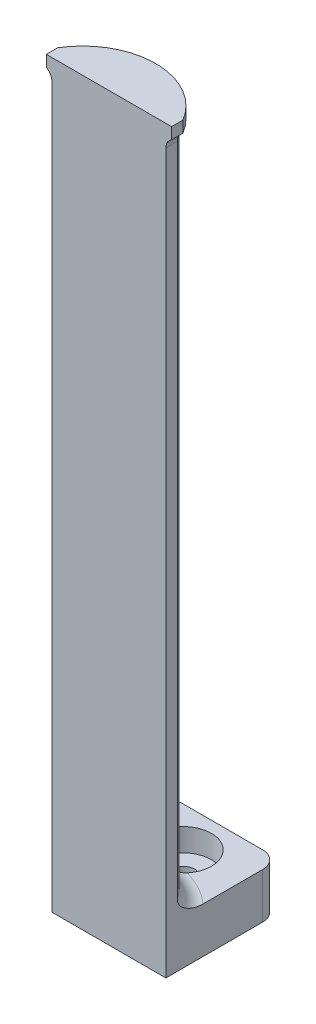
ISO-10303-21;
HEADER;
FILE_DESCRIPTION(('STEP AP214'),'2;1');
FILE_NAME('part.step','',(''),(''),'','','');
FILE_SCHEMA(('AUTOMOTIVE_DESIGN { 1 0 10303 214 1 1 1 1 }'));
ENDSEC;
DATA;
#1=APPLICATION_CONTEXT('core data for automotive mechanical design processes');
#2=APPLICATION_PROTOCOL_DEFINITION('international standard','automotive_design',2000,#1);
#3=PRODUCT_CONTEXT('',#1,'mechanical');
#4=PRODUCT('Part','Part','',(#3));
#5=PRODUCT_RELATED_PRODUCT_CATEGORY('part','',(#4));
#6=PRODUCT_DEFINITION_FORMATION('','',#4);
#7=PRODUCT_DEFINITION_CONTEXT('part definition',#1,'design');
#8=PRODUCT_DEFINITION('design','',#6,#7);
#9=PRODUCT_DEFINITION_SHAPE('','',#8);
#10=(LENGTH_UNIT() NAMED_UNIT(*) SI_UNIT(.MILLI.,.METRE.));
#11=(NAMED_UNIT(*) PLANE_ANGLE_UNIT() SI_UNIT($,.RADIAN.));
#12=(NAMED_UNIT(*) SI_UNIT($,.STERADIAN.) SOLID_ANGLE_UNIT());
#13=UNCERTAINTY_MEASURE_WITH_UNIT(LENGTH_MEASURE(1.E-05),#10,'distance_accuracy_value','');
#14=(GEOMETRIC_REPRESENTATION_CONTEXT(3) GLOBAL_UNCERTAINTY_ASSIGNED_CONTEXT((#13)) GLOBAL_UNIT_ASSIGNED_CONTEXT((#10,
#11,#12)) REPRESENTATION_CONTEXT('',''));
#15=CARTESIAN_POINT('',(0.,0.,0.));
#16=DIRECTION('',(0.,0.,1.));
#17=DIRECTION('',(1.,0.,0.));
#18=AXIS2_PLACEMENT_3D('',#15,#16,#17);
#19=CARTESIAN_POINT('',(0.,-8.,-11.));
#20=DIRECTION('',(0.,1.,0.));
#21=DIRECTION('',(0.,0.,1.));
#22=AXIS2_PLACEMENT_3D('',#19,#20,#21);
#23=CYLINDRICAL_SURFACE('',#22,2.1);
#24=CARTESIAN_POINT('',(0.,-8.,-11.));
#25=DIRECTION('',(0.,1.,0.));
#26=DIRECTION('',(0.,0.,1.));
#27=AXIS2_PLACEMENT_3D('',#24,#25,#26);
#28=CIRCLE('',#27,2.1);
#29=CARTESIAN_POINT('',(0.,-8.,-8.9));
#30=VERTEX_POINT('',#29);
#31=EDGE_CURVE('E188',#30,#30,#28,.T.);
#32=ORIENTED_EDGE('',*,*,#31,.F.);
#33=EDGE_LOOP('',(#32));
#34=FACE_BOUND('',#33,.T.);
#35=CARTESIAN_POINT('',(0.,-4.,-11.));
#36=DIRECTION('',(0.,1.,0.));
#37=DIRECTION('',(0.,0.,1.));
#38=AXIS2_PLACEMENT_3D('',#35,#36,#37);
#39=CIRCLE('',#38,2.1);
#40=CARTESIAN_POINT('',(0.,-4.,-8.9));
#41=VERTEX_POINT('',#40);
#42=EDGE_CURVE('E185',#41,#41,#39,.F.);
#43=ORIENTED_EDGE('',*,*,#42,.F.);
#44=EDGE_LOOP('',(#43));
#45=FACE_BOUND('',#44,.T.);
#46=ADVANCED_FACE('F35',(#34,#45),#23,.F.);
#47=CARTESIAN_POINT('',(0.,120.,6.6332495807108));
#48=DIRECTION('',(0.,-1.,0.));
#49=DIRECTION('',(0.,0.,-1.));
#50=AXIS2_PLACEMENT_3D('',#47,#48,#49);
#51=CYLINDRICAL_SURFACE('',#50,12.);
#52=CARTESIAN_POINT('',(-10.,118.267949192431,0.));
#53=CARTESIAN_POINT('',(-10.0000006344976,118.284499881133,7.70455485506158E-07));
#54=CARTESIAN_POINT('',(-10.0002056981213,118.301033970581,0.000309946625266893));
#55=CARTESIAN_POINT('',(-10.001024683621,118.334068950967,0.00154511039346454));
#56=CARTESIAN_POINT('',(-10.0016386054971,118.350569841906,0.00247109799192386));
#57=CARTESIAN_POINT('',(-10.0024569564994,118.367054133591,0.00370549130472211));
#58=B_SPLINE_CURVE_WITH_KNOTS('',3,(#52,#53,#54,#55,#56,#57),.UNSPECIFIED.,.F.,.F.,(4,2,4),(0.,
0.0496147537899057,0.0992295075832748),.UNSPECIFIED.);
#59=CARTESIAN_POINT('',(-10.,118.267949192431,0.));
#60=VERTEX_POINT('',#59);
#61=CARTESIAN_POINT('',(-10.0024569564994,118.367054133591,0.00370549130472211));
#62=VERTEX_POINT('',#61);
#63=EDGE_CURVE('E331',#60,#62,#58,.T.);
#64=ORIENTED_EDGE('',*,*,#63,.T.);
#65=CARTESIAN_POINT('',(0.,118.367054133591,6.6332495807108));
#66=DIRECTION('',(0.,1.,0.));
#67=DIRECTION('',(0.,0.,1.));
#68=AXIS2_PLACEMENT_3D('',#65,#66,#67);
#69=CIRCLE('',#68,12.);
#70=CARTESIAN_POINT('',(10.0024569564994,118.367054133591,0.00370549130472211));
#71=VERTEX_POINT('',#70);
#72=EDGE_CURVE('E56',#62,#71,#69,.F.);
#73=ORIENTED_EDGE('',*,*,#72,.T.);
#74=CARTESIAN_POINT('',(10.0024569564994,118.367054133591,0.00370549130472211));
#75=CARTESIAN_POINT('',(10.0016386054971,118.350569841906,0.00247109799194646));
#76=CARTESIAN_POINT('',(10.001024683621,118.334068950967,0.0015451103934871));
#77=CARTESIAN_POINT('',(10.0002056981213,118.301033970581,0.00030994662524405));
#78=CARTESIAN_POINT('',(10.0000006344975,118.284499881133,7.70455417335265E-07));
#79=CARTESIAN_POINT('',(10.,118.267949192431,-1.36110679067516E-13));
#80=B_SPLINE_CURVE_WITH_KNOTS('',3,(#74,#75,#76,#77,#78,#79),.UNSPECIFIED.,.F.,.F.,(4,2,4),(0.,
0.0496147537933691,0.0992295075832774),.UNSPECIFIED.);
#81=CARTESIAN_POINT('',(10.,118.267949192431,0.));
#82=VERTEX_POINT('',#81);
#83=EDGE_CURVE('E48',#71,#82,#80,.T.);
#84=ORIENTED_EDGE('',*,*,#83,.T.);
#85=DIRECTION('',(0.,-1.,0.));
#86=VECTOR('',#85,1.);
#87=CARTESIAN_POINT('',(10.,120.,0.));
#88=LINE('',#87,#86);
#89=CARTESIAN_POINT('',(10.,3.,0.));
#90=VERTEX_POINT('',#89);
#91=EDGE_CURVE('E201',#82,#90,#88,.T.);
#92=ORIENTED_EDGE('',*,*,#91,.T.);
#93=CARTESIAN_POINT('',(0.,3.,6.6332495807108));
#94=DIRECTION('',(0.,1.,0.));
#95=DIRECTION('',(0.,0.,1.));
#96=AXIS2_PLACEMENT_3D('',#93,#94,#95);
#97=CIRCLE('',#96,12.);
#98=CARTESIAN_POINT('',(-10.,3.,0.));
#99=VERTEX_POINT('',#98);
#100=EDGE_CURVE('E212',#90,#99,#97,.T.);
#101=ORIENTED_EDGE('',*,*,#100,.T.);
#102=DIRECTION('',(0.,-1.,0.));
#103=VECTOR('',#102,1.);
#104=CARTESIAN_POINT('',(-10.,120.,0.));
#105=LINE('',#104,#103);
#106=EDGE_CURVE('E210',#60,#99,#105,.T.);
#107=ORIENTED_EDGE('',*,*,#106,.F.);
#108=EDGE_LOOP('',(#64,#73,#84,#92,#101,#107));
#109=FACE_BOUND('',#108,.T.);
#110=ADVANCED_FACE('F243',(#109),#51,.T.);
#111=CARTESIAN_POINT('',(0.,0.,0.));
#112=DIRECTION('',(0.,1.,0.));
#113=DIRECTION('',(0.,0.,1.));
#114=AXIS2_PLACEMENT_3D('',#111,#112,#113);
#115=PLANE('',#114);
#116=CARTESIAN_POINT('',(0.,0.,-11.));
#117=DIRECTION('',(0.,1.,0.));
#118=DIRECTION('',(0.,0.,1.));
#119=AXIS2_PLACEMENT_3D('',#116,#117,#118);
#120=CIRCLE('',#119,5.);
#121=CARTESIAN_POINT('',(3.88660542498167,0.,-7.85447965027993));
#122=VERTEX_POINT('',#121);
#123=CARTESIAN_POINT('',(-3.88660542498167,0.,-7.85447965027993));
#124=VERTEX_POINT('',#123);
#125=EDGE_CURVE('E186',#122,#124,#120,.T.);
#126=ORIENTED_EDGE('',*,*,#125,.F.);
#127=CARTESIAN_POINT('',(0.,0.,6.6332495807108));
#128=DIRECTION('',(0.,1.,0.));
#129=DIRECTION('',(0.,0.,1.));
#130=AXIS2_PLACEMENT_3D('',#127,#128,#129);
#131=CIRCLE('',#130,15.);
#132=CARTESIAN_POINT('',(10.,0.,-4.54709030678815));
#133=VERTEX_POINT('',#132);
#134=EDGE_CURVE('E215',#122,#133,#131,.F.);
#135=ORIENTED_EDGE('',*,*,#134,.T.);
#136=DIRECTION('',(0.,0.,1.));
#137=VECTOR('',#136,1.);
#138=CARTESIAN_POINT('',(10.,0.,0.));
#139=LINE('',#138,#137);
#140=CARTESIAN_POINT('',(10.,0.,-15.));
#141=VERTEX_POINT('',#140);
#142=EDGE_CURVE('E191',#141,#133,#139,.T.);
#143=ORIENTED_EDGE('',*,*,#142,.F.);
#144=CARTESIAN_POINT('',(7.,0.,-15.));
#145=DIRECTION('',(0.,1.,0.));
#146=DIRECTION('',(0.,0.,1.));
#147=AXIS2_PLACEMENT_3D('',#144,#145,#146);
#148=CIRCLE('',#147,3.);
#149=CARTESIAN_POINT('',(7.,0.,-18.));
#150=VERTEX_POINT('',#149);
#151=EDGE_CURVE('E300',#141,#150,#148,.T.);
#152=ORIENTED_EDGE('',*,*,#151,.T.);
#153=DIRECTION('',(1.,0.,0.));
#154=VECTOR('',#153,1.);
#155=CARTESIAN_POINT('',(10.,0.,-18.));
#156=LINE('',#155,#154);
#157=CARTESIAN_POINT('',(-7.,0.,-18.));
#158=VERTEX_POINT('',#157);
#159=EDGE_CURVE('E195',#158,#150,#156,.T.);
#160=ORIENTED_EDGE('',*,*,#159,.F.);
#161=CARTESIAN_POINT('',(-7.,0.,-15.));
#162=DIRECTION('',(0.,1.,0.));
#163=DIRECTION('',(0.,0.,1.));
#164=AXIS2_PLACEMENT_3D('',#161,#162,#163);
#165=CIRCLE('',#164,3.);
#166=CARTESIAN_POINT('',(-10.,0.,-15.));
#167=VERTEX_POINT('',#166);
#168=EDGE_CURVE('E299',#158,#167,#165,.T.);
#169=ORIENTED_EDGE('',*,*,#168,.T.);
#170=DIRECTION('',(0.,0.,-1.));
#171=VECTOR('',#170,1.);
#172=CARTESIAN_POINT('',(-10.,0.,0.));
#173=LINE('',#172,#171);
#174=CARTESIAN_POINT('',(-10.,0.,-4.54709030678815));
#175=VERTEX_POINT('',#174);
#176=EDGE_CURVE('E204',#175,#167,#173,.T.);
#177=ORIENTED_EDGE('',*,*,#176,.F.);
#178=EDGE_CURVE('E216',#175,#124,#131,.F.);
#179=ORIENTED_EDGE('',*,*,#178,.T.);
#180=EDGE_LOOP('',(#126,#135,#143,#152,#160,#169,#177,#179));
#181=FACE_BOUND('',#180,.T.);
#182=ADVANCED_FACE('F276',(#181),#115,.T.);
#183=CARTESIAN_POINT('',(10.,-8.,0.));
#184=DIRECTION('',(-1.,0.,0.));
#185=DIRECTION('',(0.,0.,1.));
#186=AXIS2_PLACEMENT_3D('',#183,#184,#185);
#187=PLANE('',#186);
#188=ORIENTED_EDGE('',*,*,#91,.F.);
#189=DIRECTION('',(0.,0.,-1.));
#190=VECTOR('',#189,1.);
#191=CARTESIAN_POINT('',(10.,118.267949192431,0.));
#192=LINE('',#191,#190);
#193=CARTESIAN_POINT('',(10.,118.267949192431,2.));
#194=VERTEX_POINT('',#193);
#195=EDGE_CURVE('E325',#82,#194,#192,.F.);
#196=ORIENTED_EDGE('',*,*,#195,.T.);
#197=DIRECTION('',(0.,1.,0.));
#198=VECTOR('',#197,1.);
#199=CARTESIAN_POINT('',(10.,120.,2.));
#200=LINE('',#199,#198);
#201=CARTESIAN_POINT('',(10.,-8.,2.));
#202=VERTEX_POINT('',#201);
#203=EDGE_CURVE('E181',#202,#194,#200,.T.);
#204=ORIENTED_EDGE('',*,*,#203,.F.);
#205=DIRECTION('',(0.,0.,1.));
#206=VECTOR('',#205,1.);
#207=CARTESIAN_POINT('',(10.,-8.,0.));
#208=LINE('',#207,#206);
#209=CARTESIAN_POINT('',(10.,-8.,-15.));
#210=VERTEX_POINT('',#209);
#211=EDGE_CURVE('E192',#210,#202,#208,.T.);
#212=ORIENTED_EDGE('',*,*,#211,.F.);
#213=DIRECTION('',(0.,1.,0.));
#214=VECTOR('',#213,1.);
#215=CARTESIAN_POINT('',(10.,-8.,-15.));
#216=LINE('',#215,#214);
#217=EDGE_CURVE('E258',#210,#141,#216,.T.);
#218=ORIENTED_EDGE('',*,*,#217,.T.);
#219=ORIENTED_EDGE('',*,*,#142,.T.);
#220=CARTESIAN_POINT('',(10.,0.,-4.54709030678815));
#221=CARTESIAN_POINT('',(10.,2.45667950123257E-05,-4.38574645608543));
#222=CARTESIAN_POINT('',(10.,0.00723066505348418,-4.22446150557407));
#223=CARTESIAN_POINT('',(10.,0.0353273153937686,-3.90313191533755));
#224=CARTESIAN_POINT('',(10.,0.0562134736052458,-3.74308689405688));
#225=CARTESIAN_POINT('',(10.,0.11136805441,-3.4230758106674));
#226=CARTESIAN_POINT('',(10.,0.145816034494874,-3.26314091816503));
#227=CARTESIAN_POINT('',(10.,0.227597291311341,-2.94659161798994));
#228=CARTESIAN_POINT('',(10.,0.274931365114446,-2.78997741636526));
#229=CARTESIAN_POINT('',(10.,0.382615096422341,-2.4799755936431));
#230=CARTESIAN_POINT('',(10.,0.443058979715371,-2.32662065195902));
#231=CARTESIAN_POINT('',(10.,0.576793548683761,-2.02552026208566));
#232=CARTESIAN_POINT('',(10.,0.650089362540703,-1.87777708184164));
#233=CARTESIAN_POINT('',(10.,0.809403592218839,-1.59043916781549));
#234=CARTESIAN_POINT('',(10.,0.895342707347177,-1.45080070921055));
#235=CARTESIAN_POINT('',(10.,1.08097390011191,-1.18111527128585));
#236=CARTESIAN_POINT('',(10.,1.18064841271973,-1.05105636235455));
#237=CARTESIAN_POINT('',(10.,1.37587179114769,-0.826094460132072));
#238=CARTESIAN_POINT('',(10.,1.46895527572621,-0.729069471930688));
#239=CARTESIAN_POINT('',(10.,1.66626235566257,-0.5467315970043));
#240=CARTESIAN_POINT('',(10.,1.7704963312149,-0.461429795340072));
#241=CARTESIAN_POINT('',(10.,1.99246039389884,-0.306075410708397));
#242=CARTESIAN_POINT('',(10.,2.11036422939866,-0.236261825256658));
#243=CARTESIAN_POINT('',(10.,2.29529120596511,-0.149484575382667));
#244=CARTESIAN_POINT('',(10.,2.35815990553379,-0.12357954770205));
#245=CARTESIAN_POINT('',(10.,2.48626552871879,-0.0785701258350071));
#246=CARTESIAN_POINT('',(10.,2.55150038696563,-0.0594599508382668));
#247=CARTESIAN_POINT('',(10.,2.68012980981298,-0.0297030379592797));
#248=CARTESIAN_POINT('',(10.,2.74342977418696,-0.0186504383394069));
#249=CARTESIAN_POINT('',(10.,2.87113647811314,-0.00375564596328939));
#250=CARTESIAN_POINT('',(10.,2.93554675637443,5.59808173509131E-05));
#251=CARTESIAN_POINT('',(10.,3.,0.));
#252=B_SPLINE_CURVE_WITH_KNOTS('',3,(#220,#221,#222,#223,#224,#225,#226,#227,#228,#229,#230,
#231,#232,#233,#234,#235,#236,#237,#238,#239,#240,#241,#242,#243,#244,#245,#246,#247,#248,#249,
#250,#251),.UNSPECIFIED.,.F.,.F.,(4,2,2,2,2,2,2,2,2,2,2,2,2,2,2,4),(0.,0.4837876846312,
0.967420058638288,1.45768350424396,1.94797728207117,2.44191924213824,2.93605874547637,
3.42722155470139,3.91776198794497,4.32033727971272,4.72329065224446,5.13208569231605,
5.33576067863839,5.53926196882329,5.73162882951419,5.92480593042345),.UNSPECIFIED.);
#253=EDGE_CURVE('E226',#133,#90,#252,.T.);
#254=ORIENTED_EDGE('',*,*,#253,.T.);
#255=EDGE_LOOP('',(#188,#196,#204,#212,#218,#219,#254));
#256=FACE_BOUND('',#255,.T.);
#257=ADVANCED_FACE('F278',(#256),#187,.F.);
#258=CARTESIAN_POINT('',(-10.,-8.,0.));
#259=DIRECTION('',(1.,0.,0.));
#260=DIRECTION('',(0.,0.,-1.));
#261=AXIS2_PLACEMENT_3D('',#258,#259,#260);
#262=PLANE('',#261);
#263=DIRECTION('',(0.,-1.,0.));
#264=VECTOR('',#263,1.);
#265=CARTESIAN_POINT('',(-10.,120.,2.));
#266=LINE('',#265,#264);
#267=CARTESIAN_POINT('',(-10.,118.267949192431,2.));
#268=VERTEX_POINT('',#267);
#269=CARTESIAN_POINT('',(-10.,-8.,2.));
#270=VERTEX_POINT('',#269);
#271=EDGE_CURVE('E171',#268,#270,#266,.T.);
#272=ORIENTED_EDGE('',*,*,#271,.F.);
#273=DIRECTION('',(0.,0.,1.));
#274=VECTOR('',#273,1.);
#275=CARTESIAN_POINT('',(-10.,118.267949192431,0.));
#276=LINE('',#275,#274);
#277=EDGE_CURVE('E257',#268,#60,#276,.F.);
#278=ORIENTED_EDGE('',*,*,#277,.T.);
#279=ORIENTED_EDGE('',*,*,#106,.T.);
#280=CARTESIAN_POINT('',(-10.,3.,0.));
#281=CARTESIAN_POINT('',(-10.,2.94941463124245,2.24726680272377E-05));
#282=CARTESIAN_POINT('',(-10.,2.89884211420061,-0.00231389923123839));
#283=CARTESIAN_POINT('',(-10.,2.79817024927895,-0.0115295126729778));
#284=CARTESIAN_POINT('',(-10.,2.74807041794723,-0.0184034477416614));
#285=CARTESIAN_POINT('',(-10.,2.64923114624779,-0.0364181048290336));
#286=CARTESIAN_POINT('',(-10.,2.60048273964327,-0.0475099061161641));
#287=CARTESIAN_POINT('',(-10.,2.50406317872259,-0.0736691714064105));
#288=CARTESIAN_POINT('',(-10.,2.45639240197935,-0.0887380061166216));
#289=CARTESIAN_POINT('',(-10.,2.29054185705117,-0.148346957913529));
#290=CARTESIAN_POINT('',(-10.,2.17582352940995,-0.202759160707597));
#291=CARTESIAN_POINT('',(-10.,1.95627236801133,-0.329320108967349));
#292=CARTESIAN_POINT('',(-10.,1.85149289188355,-0.401557829932846));
#293=CARTESIAN_POINT('',(-10.,1.67396070715668,-0.541698426887507));
#294=CARTESIAN_POINT('',(-10.,1.5992051046985,-0.607114463895027));
#295=CARTESIAN_POINT('',(-10.,1.45562283282566,-0.744201613888277));
#296=CARTESIAN_POINT('',(-10.,1.3867995559265,-0.815876259437148));
#297=CARTESIAN_POINT('',(-10.,1.25469468551493,-0.964302627227587));
#298=CARTESIAN_POINT('',(-10.,1.19142067933182,-1.04106105637518));
#299=CARTESIAN_POINT('',(-10.,1.07018521344318,-1.19867670532179));
#300=CARTESIAN_POINT('',(-10.,1.01222541764832,-1.27953519665076));
#301=CARTESIAN_POINT('',(-10.,0.870748351126438,-1.49025411767752));
#302=CARTESIAN_POINT('',(-10.,0.790793159266038,-1.62251604646732));
#303=CARTESIAN_POINT('',(-10.,0.642420777964612,-1.89338998977134));
#304=CARTESIAN_POINT('',(-10.,0.574009738978362,-2.03200533954618));
#305=CARTESIAN_POINT('',(-10.,0.448456288981312,-2.31425593639396));
#306=CARTESIAN_POINT('',(-10.,0.391315171770542,-2.45789175759718));
#307=CARTESIAN_POINT('',(-10.,0.288303612258125,-2.74910673884631));
#308=CARTESIAN_POINT('',(-10.,0.242430257247353,-2.89668486884813));
#309=CARTESIAN_POINT('',(-10.,0.169320670847826,-3.16825651730062));
#310=CARTESIAN_POINT('',(-10.,0.140218857241185,-3.29175145277988));
#311=CARTESIAN_POINT('',(-10.,0.0899547779877396,-3.54033074850993));
#312=CARTESIAN_POINT('',(-10.,0.068791127322006,-3.66541482755219));
#313=CARTESIAN_POINT('',(-10.,0.0347283207048764,-3.91628188189548));
#314=CARTESIAN_POINT('',(-10.,0.0218016212322315,-4.04206109414974));
#315=CARTESIAN_POINT('',(-10.,0.00444023967471008,-4.29424867470732));
#316=CARTESIAN_POINT('',(-10.,8.77547342230396E-06,-4.42065726324003));
#317=CARTESIAN_POINT('',(-10.,0.,-4.54709030678815));
#318=B_SPLINE_CURVE_WITH_KNOTS('',3,(#280,#281,#282,#283,#284,#285,#286,#287,#288,#289,#290,
#291,#292,#293,#294,#295,#296,#297,#298,#299,#300,#301,#302,#303,#304,#305,#306,#307,#308,#309,
#310,#311,#312,#313,#314,#315,#316,#317),.UNSPECIFIED.,.F.,.F.,(4,2,2,2,2,2,2,2,2,2,2,2,2,2,2,2,
2,2,4),(0.,0.151681351259592,0.303185631587005,0.452983796200811,0.602833657175188,
0.981451028039703,1.361997901791,1.6596022356706,1.95737564659853,2.25555004435044,
2.55381748570933,3.01680011437101,3.48002863585347,3.94331030559056,4.40647209098796,
4.78685989613552,5.16718130183339,5.5462241838547,5.92541061399591),.UNSPECIFIED.);
#319=EDGE_CURVE('E219',#99,#175,#318,.T.);
#320=ORIENTED_EDGE('',*,*,#319,.T.);
#321=ORIENTED_EDGE('',*,*,#176,.T.);
#322=DIRECTION('',(0.,1.,0.));
#323=VECTOR('',#322,1.);
#324=CARTESIAN_POINT('',(-10.,-8.,-15.));
#325=LINE('',#324,#323);
#326=CARTESIAN_POINT('',(-10.,-8.,-15.));
#327=VERTEX_POINT('',#326);
#328=EDGE_CURVE('E305',#167,#327,#325,.F.);
#329=ORIENTED_EDGE('',*,*,#328,.T.);
#330=DIRECTION('',(0.,0.,-1.));
#331=VECTOR('',#330,1.);
#332=CARTESIAN_POINT('',(-10.,-8.,0.));
#333=LINE('',#332,#331);
#334=EDGE_CURVE('E194',#270,#327,#333,.T.);
#335=ORIENTED_EDGE('',*,*,#334,.F.);
#336=EDGE_LOOP('',(#272,#278,#279,#320,#321,#329,#335));
#337=FACE_BOUND('',#336,.T.);
#338=ADVANCED_FACE('F232',(#337),#262,.F.);
#339=CARTESIAN_POINT('',(10.,-8.,-18.));
#340=DIRECTION('',(0.,0.,1.));
#341=DIRECTION('',(1.,0.,0.));
#342=AXIS2_PLACEMENT_3D('',#339,#340,#341);
#343=PLANE('',#342);
#344=DIRECTION('',(1.,0.,0.));
#345=VECTOR('',#344,1.);
#346=CARTESIAN_POINT('',(10.,-8.,-18.));
#347=LINE('',#346,#345);
#348=CARTESIAN_POINT('',(-7.,-8.,-18.));
#349=VERTEX_POINT('',#348);
#350=CARTESIAN_POINT('',(7.,-8.,-18.));
#351=VERTEX_POINT('',#350);
#352=EDGE_CURVE('E198',#349,#351,#347,.T.);
#353=ORIENTED_EDGE('',*,*,#352,.F.);
#354=DIRECTION('',(0.,1.,0.));
#355=VECTOR('',#354,1.);
#356=CARTESIAN_POINT('',(-7.,-8.,-18.));
#357=LINE('',#356,#355);
#358=EDGE_CURVE('E289',#349,#158,#357,.T.);
#359=ORIENTED_EDGE('',*,*,#358,.T.);
#360=ORIENTED_EDGE('',*,*,#159,.T.);
#361=DIRECTION('',(0.,1.,0.));
#362=VECTOR('',#361,1.);
#363=CARTESIAN_POINT('',(7.,-8.,-18.));
#364=LINE('',#363,#362);
#365=EDGE_CURVE('E292',#150,#351,#364,.F.);
#366=ORIENTED_EDGE('',*,*,#365,.T.);
#367=EDGE_LOOP('',(#353,#359,#360,#366));
#368=FACE_BOUND('',#367,.T.);
#369=ADVANCED_FACE('F274',(#368),#343,.F.);
#370=CARTESIAN_POINT('',(0.,-8.,0.));
#371=DIRECTION('',(0.,1.,0.));
#372=DIRECTION('',(0.,0.,1.));
#373=AXIS2_PLACEMENT_3D('',#370,#371,#372);
#374=PLANE('',#373);
#375=ORIENTED_EDGE('',*,*,#31,.T.);
#376=EDGE_LOOP('',(#375));
#377=FACE_BOUND('',#376,.T.);
#378=ORIENTED_EDGE('',*,*,#334,.T.);
#379=CARTESIAN_POINT('',(-7.,-8.,-15.));
#380=DIRECTION('',(0.,1.,0.));
#381=DIRECTION('',(0.,0.,1.));
#382=AXIS2_PLACEMENT_3D('',#379,#380,#381);
#383=CIRCLE('',#382,3.);
#384=EDGE_CURVE('E298',#327,#349,#383,.F.);
#385=ORIENTED_EDGE('',*,*,#384,.T.);
#386=ORIENTED_EDGE('',*,*,#352,.T.);
#387=CARTESIAN_POINT('',(7.,-8.,-15.));
#388=DIRECTION('',(0.,1.,0.));
#389=DIRECTION('',(0.,0.,1.));
#390=AXIS2_PLACEMENT_3D('',#387,#388,#389);
#391=CIRCLE('',#390,3.);
#392=EDGE_CURVE('E307',#351,#210,#391,.F.);
#393=ORIENTED_EDGE('',*,*,#392,.T.);
#394=ORIENTED_EDGE('',*,*,#211,.T.);
#395=DIRECTION('',(1.,0.,0.));
#396=VECTOR('',#395,1.);
#397=CARTESIAN_POINT('',(-10.,-8.,2.));
#398=LINE('',#397,#396);
#399=EDGE_CURVE('E173',#270,#202,#398,.T.);
#400=ORIENTED_EDGE('',*,*,#399,.F.);
#401=EDGE_LOOP('',(#378,#385,#386,#393,#394,#400));
#402=FACE_BOUND('',#401,.T.);
#403=ADVANCED_FACE('F241',(#377,#402),#374,.F.);
#404=CARTESIAN_POINT('',(0.,3.,6.6332495807108));
#405=DIRECTION('',(0.,1.,0.));
#406=DIRECTION('',(0.,0.,1.));
#407=AXIS2_PLACEMENT_3D('',#404,#405,#406);
#408=TOROIDAL_SURFACE('',#407,15.,3.);
#409=ORIENTED_EDGE('',*,*,#134,.F.);
#410=CARTESIAN_POINT('',(4.25053524929728,0.0587493886185295,-8.3669504192892));
#411=CARTESIAN_POINT('',(4.20586597633188,0.0423367423067718,-8.29479738652631));
#412=CARTESIAN_POINT('',(4.15897524632466,0.0295049878824883,-8.22324568019948));
#413=CARTESIAN_POINT('',(4.06119922597061,0.0106631463614589,-8.08213125770239));
#414=CARTESIAN_POINT('',(4.01031923577035,0.00464416665828721,-8.01256606451989));
#415=CARTESIAN_POINT('',(3.90552076517099,-0.000920023380407513,-7.87683022533181));
#416=CARTESIAN_POINT('',(3.85164558340162,-0.00054132308873065,-7.81062906176429));
#417=CARTESIAN_POINT('',(3.74071915894545,0.00601865156107786,-7.68122238279594));
#418=CARTESIAN_POINT('',(3.68366675391714,0.0122020627822565,-7.61801797958109));
#419=CARTESIAN_POINT('',(3.5540219214285,0.0317571651427291,-7.48153239988418));
#420=CARTESIAN_POINT('',(3.48075904777409,0.0464048764929101,-7.40906928160826));
#421=CARTESIAN_POINT('',(3.33079516026823,0.0824340382234949,-7.26954223686603));
#422=CARTESIAN_POINT('',(3.25409172954771,0.10382028778998,-7.20248220135069));
#423=CARTESIAN_POINT('',(3.0189900659366,0.176659840601749,-7.00914051211118));
#424=CARTESIAN_POINT('',(2.85619936726156,0.236687303720629,-6.89132189821779));
#425=CARTESIAN_POINT('',(2.56504183453896,0.353415642793017,-6.7055442451204));
#426=CARTESIAN_POINT('',(2.43851986550884,0.407040484128521,-6.63254010811566));
#427=CARTESIAN_POINT('',(2.1809218367443,0.518441032729683,-6.49836983992643));
#428=CARTESIAN_POINT('',(2.04984164162802,0.576220562838082,-6.43721480758713));
#429=CARTESIAN_POINT('',(1.78297484840061,0.691951987502827,-6.32647003144189));
#430=CARTESIAN_POINT('',(1.64718845099817,0.749903874612417,-6.27687979511945));
#431=CARTESIAN_POINT('',(1.37024699720412,0.861127351294946,-6.18922890670635));
#432=CARTESIAN_POINT('',(1.22909844757921,0.914404369092946,-6.15115475350298));
#433=CARTESIAN_POINT('',(0.935542487813468,1.01146521277528,-6.08593856963706));
#434=CARTESIAN_POINT('',(0.782919595863801,1.05489222868043,-6.05918377158746));
#435=CARTESIAN_POINT('',(0.549756077152734,1.1044302565937,-6.02970164100852));
#436=CARTESIAN_POINT('',(0.47153927771313,1.11832642789615,-6.02165650485638));
#437=CARTESIAN_POINT('',(0.313992775491901,1.14000505134168,-6.00924426791305));
#438=CARTESIAN_POINT('',(0.234663750346024,1.14779107434128,-6.00487501877406));
#439=CARTESIAN_POINT('',(0.0746762050942058,1.15665022514019,-5.99991065412758));
#440=CARTESIAN_POINT('',(-0.00598756463549474,1.15765276341452,-5.99935522467731));
#441=CARTESIAN_POINT('',(-0.167027919317705,1.15266655513929,-6.00214160522661));
#442=CARTESIAN_POINT('',(-0.247404491937736,1.14667751189993,-6.00548358061369));
#443=CARTESIAN_POINT('',(-0.407463644118907,1.128198429251,-6.01598206537871));
#444=CARTESIAN_POINT('',(-0.487142139263852,1.11568237358721,-6.02315384286965));
#445=CARTESIAN_POINT('',(-0.645022305452736,1.08510111840321,-6.04114267541374));
#446=CARTESIAN_POINT('',(-0.723223161946565,1.06703294785039,-6.05196168246402));
#447=CARTESIAN_POINT('',(-0.918962030185514,1.01573934670489,-6.08371055905352));
#448=CARTESIAN_POINT('',(-1.03534451507713,0.979559374089902,-6.10695894875822));
#449=CARTESIAN_POINT('',(-1.26412796666053,0.900830699142685,-6.16101010495472));
#450=CARTESIAN_POINT('',(-1.3765257223057,0.85827699868156,-6.19181881228404));
#451=CARTESIAN_POINT('',(-1.59821737864153,0.769842002761306,-6.26088294861876));
#452=CARTESIAN_POINT('',(-1.70749672058214,0.723947821293483,-6.29916829033938));
#453=CARTESIAN_POINT('',(-1.92288455708384,0.63156558606983,-6.38308886159493));
#454=CARTESIAN_POINT('',(-2.0289939307261,0.585077702158766,-6.42872203060679));
#455=CARTESIAN_POINT('',(-2.25213299261128,0.487601064637202,-6.53401156067541));
#456=CARTESIAN_POINT('',(-2.36876194123368,0.436825186856541,-6.59472309567906));
#457=CARTESIAN_POINT('',(-2.59838049191007,0.339961051312773,-6.72613546939727));
#458=CARTESIAN_POINT('',(-2.71136886342532,0.293874367402042,-6.79683964308256));
#459=CARTESIAN_POINT('',(-2.93268608099066,0.20926988910278,-6.94818341030035));
#460=CARTESIAN_POINT('',(-3.0410344342613,0.170717333813977,-7.02877444060292));
#461=CARTESIAN_POINT('',(-3.25256410749759,0.103621161876438,-7.20008552869145));
#462=CARTESIAN_POINT('',(-3.35575045516194,0.0750676370021584,-7.29079544125769));
#463=CARTESIAN_POINT('',(-3.57421540040697,0.0265496161632775,-7.49975345389088));
#464=CARTESIAN_POINT('',(-3.6882204356452,0.00913594105617117,-7.61999636082697));
#465=CARTESIAN_POINT('',(-3.8500199871561,-0.000451486572313811,-7.80872318331353));
#466=CARTESIAN_POINT('',(-3.90238629106351,-0.000897040086250551,-7.87297972985255));
#467=CARTESIAN_POINT('',(-4.00374713719066,0.00412249106250111,-8.00386305839386));
#468=CARTESIAN_POINT('',(-4.05274364689848,0.0095840950719999,-8.07048842226649));
#469=CARTESIAN_POINT('',(-4.12617989195975,0.0229605739254944,-8.17568465346045));
#470=CARTESIAN_POINT('',(-4.15190639542635,0.0287259774231706,-8.21364735064065));
#471=CARTESIAN_POINT('',(-4.20214172278461,0.0422404578260847,-8.29000112867364));
#472=CARTESIAN_POINT('',(-4.22665100662685,0.0499887785311135,-8.32839204089731));
#473=CARTESIAN_POINT('',(-4.25053524929729,0.0587493886185177,-8.3669504192892));
#474=B_SPLINE_CURVE_WITH_KNOTS('',3,(#410,#411,#412,#413,#414,#415,#416,#417,#418,#419,#420,
#421,#422,#423,#424,#425,#426,#427,#428,#429,#430,#431,#432,#433,#434,#435,#436,#437,#438,#439,
#440,#441,#442,#443,#444,#445,#446,#447,#448,#449,#450,#451,#452,#453,#454,#455,#456,#457,#458,
#459,#460,#461,#462,#463,#464,#465,#466,#467,#468,#469,#470,#471,#472,#473),.UNSPECIFIED.,.F.,
.F.,(4,2,2,2,2,2,2,2,2,2,2,2,2,2,2,2,2,2,2,2,2,2,2,2,2,2,2,2,2,2,2,4),(0.,0.259148724976961,
0.517958795748294,0.773692956898911,1.02952129728915,1.34128183960074,1.65326492152533,
2.27981375448594,2.74611061228705,3.21284215263351,3.67955381238878,4.14571617334129,
4.62674050478356,4.86600910699234,5.10513777291745,5.34675105616405,5.58837459271366,
5.83096867085675,6.0736927920162,6.44526989992786,6.81713993043951,7.19052941021665,
7.56381436358667,7.98622781887073,8.40878258596276,8.82933919353826,9.24947787658726,
9.74700414623937,9.99543249057856,10.2437145340834,10.3823198670504,10.5208724204073),.UNSPECIFIED.);
#475=EDGE_CURVE('E249',#122,#124,#474,.T.);
#476=ORIENTED_EDGE('',*,*,#475,.T.);
#477=ORIENTED_EDGE('',*,*,#178,.F.);
#478=ORIENTED_EDGE('',*,*,#319,.F.);
#479=ORIENTED_EDGE('',*,*,#100,.F.);
#480=ORIENTED_EDGE('',*,*,#253,.F.);
#481=EDGE_LOOP('',(#409,#476,#477,#478,#479,#480));
#482=FACE_BOUND('',#481,.T.);
#483=ADVANCED_FACE('F235',(#482),#408,.F.);
#484=CARTESIAN_POINT('',(-7.,-8.,-15.));
#485=DIRECTION('',(0.,1.,0.));
#486=DIRECTION('',(0.,0.,1.));
#487=AXIS2_PLACEMENT_3D('',#484,#485,#486);
#488=CYLINDRICAL_SURFACE('',#487,3.);
#489=ORIENTED_EDGE('',*,*,#384,.F.);
#490=ORIENTED_EDGE('',*,*,#328,.F.);
#491=ORIENTED_EDGE('',*,*,#168,.F.);
#492=ORIENTED_EDGE('',*,*,#358,.F.);
#493=EDGE_LOOP('',(#489,#490,#491,#492));
#494=FACE_BOUND('',#493,.T.);
#495=ADVANCED_FACE('F240',(#494),#488,.T.);
#496=CARTESIAN_POINT('',(7.,-8.,-15.));
#497=DIRECTION('',(0.,1.,0.));
#498=DIRECTION('',(0.,0.,1.));
#499=AXIS2_PLACEMENT_3D('',#496,#497,#498);
#500=CYLINDRICAL_SURFACE('',#499,3.);
#501=ORIENTED_EDGE('',*,*,#392,.F.);
#502=ORIENTED_EDGE('',*,*,#365,.F.);
#503=ORIENTED_EDGE('',*,*,#151,.F.);
#504=ORIENTED_EDGE('',*,*,#217,.F.);
#505=EDGE_LOOP('',(#501,#502,#503,#504));
#506=FACE_BOUND('',#505,.T.);
#507=ADVANCED_FACE('F348',(#506),#500,.T.);
#508=CARTESIAN_POINT('',(0.,-4.,-11.));
#509=DIRECTION('',(0.,1.,0.));
#510=DIRECTION('',(0.,0.,1.));
#511=AXIS2_PLACEMENT_3D('',#508,#509,#510);
#512=PLANE('',#511);
#513=CARTESIAN_POINT('',(0.,-4.,-11.));
#514=DIRECTION('',(0.,1.,0.));
#515=DIRECTION('',(0.,0.,1.));
#516=AXIS2_PLACEMENT_3D('',#513,#514,#515);
#517=CIRCLE('',#516,5.);
#518=CARTESIAN_POINT('',(0.,-4.,-6.));
#519=VERTEX_POINT('',#518);
#520=EDGE_CURVE('E182',#519,#519,#517,.T.);
#521=ORIENTED_EDGE('',*,*,#520,.T.);
#522=EDGE_LOOP('',(#521));
#523=FACE_BOUND('',#522,.T.);
#524=ORIENTED_EDGE('',*,*,#42,.T.);
#525=EDGE_LOOP('',(#524));
#526=FACE_BOUND('',#525,.T.);
#527=ADVANCED_FACE('F266',(#523,#526),#512,.T.);
#528=CARTESIAN_POINT('',(0.,-4.,-11.));
#529=DIRECTION('',(0.,1.,0.));
#530=DIRECTION('',(0.,0.,1.));
#531=AXIS2_PLACEMENT_3D('',#528,#529,#530);
#532=CYLINDRICAL_SURFACE('',#531,5.);
#533=ORIENTED_EDGE('',*,*,#125,.T.);
#534=ORIENTED_EDGE('',*,*,#475,.F.);
#535=EDGE_LOOP('',(#533,#534));
#536=FACE_BOUND('',#535,.T.);
#537=ORIENTED_EDGE('',*,*,#520,.F.);
#538=EDGE_LOOP('',(#537));
#539=FACE_BOUND('',#538,.T.);
#540=ADVANCED_FACE('F261',(#536,#539),#532,.F.);
#541=CARTESIAN_POINT('',(0.,0.,2.));
#542=DIRECTION('',(0.,0.,1.));
#543=DIRECTION('',(1.,0.,0.));
#544=AXIS2_PLACEMENT_3D('',#541,#542,#543);
#545=PLANE('',#544);
#546=DIRECTION('',(0.,-1.,0.));
#547=VECTOR('',#546,1.);
#548=CARTESIAN_POINT('',(-11.,122.,2.));
#549=LINE('',#548,#547);
#550=CARTESIAN_POINT('',(-11.,122.,2.));
#551=VERTEX_POINT('',#550);
#552=CARTESIAN_POINT('',(-11.,120.,2.));
#553=VERTEX_POINT('',#552);
#554=EDGE_CURVE('E149',#551,#553,#549,.T.);
#555=ORIENTED_EDGE('',*,*,#554,.T.);
#556=CARTESIAN_POINT('',(-12.,118.267949192431,2.));
#557=DIRECTION('',(0.,0.,1.));
#558=DIRECTION('',(1.,0.,0.));
#559=AXIS2_PLACEMENT_3D('',#556,#557,#558);
#560=CIRCLE('',#559,2.);
#561=EDGE_CURVE('E333',#553,#268,#560,.F.);
#562=ORIENTED_EDGE('',*,*,#561,.T.);
#563=ORIENTED_EDGE('',*,*,#271,.T.);
#564=ORIENTED_EDGE('',*,*,#399,.T.);
#565=ORIENTED_EDGE('',*,*,#203,.T.);
#566=CARTESIAN_POINT('',(12.,118.267949192431,2.));
#567=DIRECTION('',(0.,0.,1.));
#568=DIRECTION('',(1.,0.,0.));
#569=AXIS2_PLACEMENT_3D('',#566,#567,#568);
#570=CIRCLE('',#569,2.);
#571=CARTESIAN_POINT('',(11.,120.,2.));
#572=VERTEX_POINT('',#571);
#573=EDGE_CURVE('E11',#194,#572,#570,.F.);
#574=ORIENTED_EDGE('',*,*,#573,.T.);
#575=DIRECTION('',(0.,-1.,0.));
#576=VECTOR('',#575,1.);
#577=CARTESIAN_POINT('',(11.,122.,2.));
#578=LINE('',#577,#576);
#579=CARTESIAN_POINT('',(11.,122.,2.));
#580=VERTEX_POINT('',#579);
#581=EDGE_CURVE('E152',#580,#572,#578,.T.);
#582=ORIENTED_EDGE('',*,*,#581,.F.);
#583=DIRECTION('',(1.,0.,0.));
#584=VECTOR('',#583,1.);
#585=CARTESIAN_POINT('',(-11.,122.,2.));
#586=LINE('',#585,#584);
#587=EDGE_CURVE('E145',#551,#580,#586,.T.);
#588=ORIENTED_EDGE('',*,*,#587,.F.);
#589=EDGE_LOOP('',(#555,#562,#563,#564,#565,#574,#582,#588));
#590=FACE_BOUND('',#589,.T.);
#591=ADVANCED_FACE('F147',(#590),#545,.T.);
#592=CARTESIAN_POINT('',(-11.,122.,0.));
#593=DIRECTION('',(1.,0.,0.));
#594=DIRECTION('',(0.,0.,-1.));
#595=AXIS2_PLACEMENT_3D('',#592,#593,#594);
#596=PLANE('',#595);
#597=DIRECTION('',(0.,0.,1.));
#598=VECTOR('',#597,1.);
#599=CARTESIAN_POINT('',(-11.,120.,0.));
#600=LINE('',#599,#598);
#601=CARTESIAN_POINT('',(-11.,120.,0.));
#602=VERTEX_POINT('',#601);
#603=EDGE_CURVE('E169',#602,#553,#600,.T.);
#604=ORIENTED_EDGE('',*,*,#603,.T.);
#605=ORIENTED_EDGE('',*,*,#554,.F.);
#606=DIRECTION('',(0.,0.,1.));
#607=VECTOR('',#606,1.);
#608=CARTESIAN_POINT('',(-11.,122.,0.));
#609=LINE('',#608,#607);
#610=CARTESIAN_POINT('',(-11.,122.,0.));
#611=VERTEX_POINT('',#610);
#612=EDGE_CURVE('E156',#611,#551,#609,.T.);
#613=ORIENTED_EDGE('',*,*,#612,.F.);
#614=DIRECTION('',(0.,-1.,0.));
#615=VECTOR('',#614,1.);
#616=CARTESIAN_POINT('',(-11.,122.,0.));
#617=LINE('',#616,#615);
#618=EDGE_CURVE('E380',#611,#602,#617,.T.);
#619=ORIENTED_EDGE('',*,*,#618,.T.);
#620=EDGE_LOOP('',(#604,#605,#613,#619));
#621=FACE_BOUND('',#620,.T.);
#622=ADVANCED_FACE('F167',(#621),#596,.F.);
#623=CARTESIAN_POINT('',(11.,122.,2.));
#624=DIRECTION('',(-1.,0.,0.));
#625=DIRECTION('',(0.,0.,1.));
#626=AXIS2_PLACEMENT_3D('',#623,#624,#625);
#627=PLANE('',#626);
#628=DIRECTION('',(0.,0.,-1.));
#629=VECTOR('',#628,1.);
#630=CARTESIAN_POINT('',(11.,120.,2.));
#631=LINE('',#630,#629);
#632=CARTESIAN_POINT('',(11.,120.,0.));
#633=VERTEX_POINT('',#632);
#634=EDGE_CURVE('E372',#572,#633,#631,.T.);
#635=ORIENTED_EDGE('',*,*,#634,.T.);
#636=DIRECTION('',(0.,-1.,0.));
#637=VECTOR('',#636,1.);
#638=CARTESIAN_POINT('',(11.,122.,0.));
#639=LINE('',#638,#637);
#640=CARTESIAN_POINT('',(11.,122.,0.));
#641=VERTEX_POINT('',#640);
#642=EDGE_CURVE('E175',#641,#633,#639,.T.);
#643=ORIENTED_EDGE('',*,*,#642,.F.);
#644=DIRECTION('',(0.,0.,-1.));
#645=VECTOR('',#644,1.);
#646=CARTESIAN_POINT('',(11.,122.,2.));
#647=LINE('',#646,#645);
#648=EDGE_CURVE('E155',#580,#641,#647,.T.);
#649=ORIENTED_EDGE('',*,*,#648,.F.);
#650=ORIENTED_EDGE('',*,*,#581,.T.);
#651=EDGE_LOOP('',(#635,#643,#649,#650));
#652=FACE_BOUND('',#651,.T.);
#653=ADVANCED_FACE('F370',(#652),#627,.F.);
#654=CARTESIAN_POINT('',(0.,122.,6.6332495807108));
#655=DIRECTION('',(0.,-1.,0.));
#656=DIRECTION('',(0.,0.,-1.));
#657=AXIS2_PLACEMENT_3D('',#654,#655,#656);
#658=CYLINDRICAL_SURFACE('',#657,12.8452325786651);
#659=CARTESIAN_POINT('',(0.,120.,6.6332495807108));
#660=DIRECTION('',(0.,1.,0.));
#661=DIRECTION('',(0.,0.,-1.));
#662=AXIS2_PLACEMENT_3D('',#659,#660,#661);
#663=CIRCLE('',#662,12.8452325786651);
#664=EDGE_CURVE('E165',#633,#602,#663,.T.);
#665=ORIENTED_EDGE('',*,*,#664,.T.);
#666=ORIENTED_EDGE('',*,*,#618,.F.);
#667=CARTESIAN_POINT('',(0.,122.,6.6332495807108));
#668=DIRECTION('',(0.,1.,0.));
#669=DIRECTION('',(0.,0.,-1.));
#670=AXIS2_PLACEMENT_3D('',#667,#668,#669);
#671=CIRCLE('',#670,12.8452325786651);
#672=EDGE_CURVE('E161',#641,#611,#671,.T.);
#673=ORIENTED_EDGE('',*,*,#672,.F.);
#674=ORIENTED_EDGE('',*,*,#642,.T.);
#675=EDGE_LOOP('',(#665,#666,#673,#674));
#676=FACE_BOUND('',#675,.T.);
#677=ADVANCED_FACE('F382',(#676),#658,.T.);
#678=CARTESIAN_POINT('',(0.,122.,6.6332495807108));
#679=DIRECTION('',(0.,-1.,0.));
#680=DIRECTION('',(0.,0.,-1.));
#681=AXIS2_PLACEMENT_3D('',#678,#679,#680);
#682=PLANE('',#681);
#683=ORIENTED_EDGE('',*,*,#612,.T.);
#684=ORIENTED_EDGE('',*,*,#587,.T.);
#685=ORIENTED_EDGE('',*,*,#648,.T.);
#686=ORIENTED_EDGE('',*,*,#672,.T.);
#687=EDGE_LOOP('',(#683,#684,#685,#686));
#688=FACE_BOUND('',#687,.T.);
#689=ADVANCED_FACE('F159',(#688),#682,.F.);
#690=CARTESIAN_POINT('',(12.,118.267949192431,6.6332495807108));
#691=DIRECTION('',(0.,0.,-1.));
#692=DIRECTION('',(-1.,0.,0.));
#693=AXIS2_PLACEMENT_3D('',#690,#691,#692);
#694=CYLINDRICAL_SURFACE('',#693,2.);
#695=ORIENTED_EDGE('',*,*,#195,.F.);
#696=ORIENTED_EDGE('',*,*,#83,.F.);
#697=CARTESIAN_POINT('',(10.0024569564994,118.367054133591,0.00370549130472211));
#698=CARTESIAN_POINT('',(10.00517510304,118.421981196282,0.00782035447012565));
#699=CARTESIAN_POINT('',(10.0101748560225,118.476841768049,0.0112601620358859));
#700=CARTESIAN_POINT('',(10.0246882112675,118.58601876658,0.0168851701879446));
#701=CARTESIAN_POINT('',(10.03420107527,118.640335280859,0.019070575841611));
#702=CARTESIAN_POINT('',(10.0576562983206,118.747866591877,0.0222786556121951));
#703=CARTESIAN_POINT('',(10.0715850255804,118.801084249295,0.0233048642684688));
#704=CARTESIAN_POINT('',(10.1037738187695,118.906189408736,0.024332200560816));
#705=CARTESIAN_POINT('',(10.1220339368997,118.958076894721,0.0243333158420834));
#706=CARTESIAN_POINT('',(10.1831496172883,119.111225918714,0.0230112046157959));
#707=CARTESIAN_POINT('',(10.2323510161919,119.210021996821,0.0203636918755792));
#708=CARTESIAN_POINT('',(10.3462964843875,119.398157035359,0.0130933360498804));
#709=CARTESIAN_POINT('',(10.4110468739721,119.487492128794,0.00846968911564135));
#710=CARTESIAN_POINT('',(10.5192478931091,119.613513098538,0.00187598271618612));
#711=CARTESIAN_POINT('',(10.5576605437561,119.654606995292,-0.000287385716932698));
#712=CARTESIAN_POINT('',(10.6378267124448,119.733432387292,-0.00397309180210829));
#713=CARTESIAN_POINT('',(10.6795796308315,119.771164483499,-0.00549554420741778));
#714=CARTESIAN_POINT('',(10.7662196431722,119.843054653029,-0.00727134537880094));
#715=CARTESIAN_POINT('',(10.8111122256036,119.877206192935,-0.00752241241094921));
#716=CARTESIAN_POINT('',(10.9036184601424,119.9416092154,-0.00573506857829561));
#717=CARTESIAN_POINT('',(10.9512344017479,119.97185734473,-0.00369470366250891));
#718=CARTESIAN_POINT('',(11.,120.,0.));
#719=B_SPLINE_CURVE_WITH_KNOTS('',3,(#697,#698,#699,#700,#701,#702,#703,#704,#705,#706,#707,
#708,#709,#710,#711,#712,#713,#714,#715,#716,#717,#718),.UNSPECIFIED.,.F.,.F.,(4,2,2,2,2,2,2,2,
2,2,4),(0.,0.165386576261516,0.330746107716998,0.49560006427092,0.660456007705922,
0.990022392031852,1.3197229646372,1.48843255428326,1.65711192434385,1.8260939134103,
1.99522011375013),.UNSPECIFIED.);
#720=EDGE_CURVE('E40',#633,#71,#719,.F.);
#721=ORIENTED_EDGE('',*,*,#720,.F.);
#722=ORIENTED_EDGE('',*,*,#634,.F.);
#723=ORIENTED_EDGE('',*,*,#573,.F.);
#724=EDGE_LOOP('',(#695,#696,#721,#722,#723));
#725=FACE_BOUND('',#724,.T.);
#726=ADVANCED_FACE('F37',(#725),#694,.F.);
#727=CARTESIAN_POINT('',(0.,118.367054133591,6.6332495807108));
#728=DIRECTION('',(0.,1.,0.));
#729=DIRECTION('',(0.,0.,1.));
#730=AXIS2_PLACEMENT_3D('',#727,#728,#729);
#731=TOROIDAL_SURFACE('',#730,14.,2.);
#732=ORIENTED_EDGE('',*,*,#72,.F.);
#733=CARTESIAN_POINT('',(-12.6490427828147,120.159705906725,3.17522310555429));
#734=CARTESIAN_POINT('',(-12.6261647061287,120.167531247484,3.03165689045918));
#735=CARTESIAN_POINT('',(-12.6017247868897,120.175475021445,2.88833028753136));
#736=CARTESIAN_POINT('',(-12.5491633285944,120.191279220808,2.60219102300527));
#737=CARTESIAN_POINT('',(-12.5210378406306,120.199139546894,2.45937908392686));
#738=CARTESIAN_POINT('',(-12.4605017611713,120.214461765364,2.17417821396783));
#739=CARTESIAN_POINT('',(-12.4280782922185,120.221922361858,2.03179192368808));
#740=CARTESIAN_POINT('',(-12.3579723047255,120.235981178968,1.74832154690007));
#741=CARTESIAN_POINT('',(-12.3202923223849,120.242579812514,1.6072368671737));
#742=CARTESIAN_POINT('',(-12.2468251184375,120.252923228375,1.35868350318217));
#743=CARTESIAN_POINT('',(-12.212520471084,120.256976064496,1.25079540957439));
#744=CARTESIAN_POINT('',(-12.1374041648921,120.263587031228,1.0369504022507));
#745=CARTESIAN_POINT('',(-12.0965796585923,120.266142163177,0.930997771565368));
#746=CARTESIAN_POINT('',(-12.0146483618398,120.268221341336,0.74640977945548));
#747=CARTESIAN_POINT('',(-11.9755986769913,120.268290546446,0.666912997713203));
#748=CARTESIAN_POINT('',(-11.9097016723066,120.266027006616,0.552004699039848));
#749=CARTESIAN_POINT('',(-11.8865541221256,120.26488127625,0.514475624734433));
#750=CARTESIAN_POINT('',(-11.8372438147135,120.261469766608,0.441529580030273));
#751=CARTESIAN_POINT('',(-11.8110839046941,120.259205038426,0.406110662444727));
#752=CARTESIAN_POINT('',(-11.750187184146,120.252563401058,0.332240094486678));
#753=CARTESIAN_POINT('',(-11.7147527286024,120.247881940691,0.294373317177034));
#754=CARTESIAN_POINT('',(-11.6386830025956,120.235414918381,0.224984337698801));
#755=CARTESIAN_POINT('',(-11.5980626026807,120.227638102285,0.193444633000621));
#756=CARTESIAN_POINT('',(-11.5124460270487,120.208107076144,0.138096290804742));
#757=CARTESIAN_POINT('',(-11.4674319957792,120.196336110204,0.114321064570742));
#758=CARTESIAN_POINT('',(-11.3752712209143,120.168486954913,0.0745757885276652));
#759=CARTESIAN_POINT('',(-11.3281188918575,120.15239687252,0.0586276394392711));
#760=CARTESIAN_POINT('',(-11.2140485677141,120.108439291321,0.0277123010923942));
#761=CARTESIAN_POINT('',(-11.1471099673049,120.078460394689,0.0159437159498037));
#762=CARTESIAN_POINT('',(-11.0162305890024,120.010842323509,0.000120093193954175));
#763=CARTESIAN_POINT('',(-10.9522993122721,119.973180646573,-0.00391191493525533));
#764=CARTESIAN_POINT('',(-10.8455578003441,119.902023568856,-0.00718661091851383));
#765=CARTESIAN_POINT('',(-10.8016907764795,119.870131027345,-0.00742559724337041));
#766=CARTESIAN_POINT('',(-10.716692361668,119.802896260517,-0.00648634330535168));
#767=CARTESIAN_POINT('',(-10.6755619897764,119.767552762112,-0.00530757819261698));
#768=CARTESIAN_POINT('',(-10.5567411610929,119.656729332536,-0.000665401271227704));
#769=CARTESIAN_POINT('',(-10.483527645683,119.576394098997,0.00390403632714767));
#770=CARTESIAN_POINT('',(-10.3502176366858,119.403851533293,0.0126767895967718));
#771=CARTESIAN_POINT('',(-10.29030439128,119.311503210121,0.0168745620242012));
#772=CARTESIAN_POINT('',(-10.1864135299197,119.11819648942,0.0227597972019987));
#773=CARTESIAN_POINT('',(-10.1424254116483,119.017243820769,0.0244489166499779));
#774=CARTESIAN_POINT('',(-10.0769646883049,118.825276590562,0.0239626853719453));
#775=CARTESIAN_POINT('',(-10.0530917235707,118.735070994912,0.0223336263533401));
#776=CARTESIAN_POINT('',(-10.018136816861,118.552329098825,0.0156763747286195));
#777=CARTESIAN_POINT('',(-10.0070552814328,118.459792724404,0.010648074093165));
#778=CARTESIAN_POINT('',(-9.99705226608502,118.25805283854,-0.00445454766366346));
#779=CARTESIAN_POINT('',(-10.0006039544702,118.148772187047,-0.0152591153119157));
#780=CARTESIAN_POINT('',(-10.0252677723546,117.932918671439,-0.0425967408096069));
#781=CARTESIAN_POINT('',(-10.0463874395461,117.826346989861,-0.0591322557944602));
#782=CARTESIAN_POINT('',(-10.1051088210758,117.619129920274,-0.0981895807265224));
#783=CARTESIAN_POINT('',(-10.1426931414954,117.518478404902,-0.120705063339973));
#784=CARTESIAN_POINT('',(-10.2326325830563,117.325753227209,-0.172024890009925));
#785=CARTESIAN_POINT('',(-10.2849909880329,117.233681477971,-0.200830631879903));
#786=CARTESIAN_POINT('',(-10.4031427066262,117.059106712237,-0.265844497507816));
#787=CARTESIAN_POINT('',(-10.4691373070287,116.97678008069,-0.302163537411547));
#788=CARTESIAN_POINT('',(-10.5751497112613,116.863493168293,-0.363080246607413));
#789=CARTESIAN_POINT('',(-10.6116722005846,116.827419817907,-0.384468023308928));
#790=CARTESIAN_POINT('',(-10.686483961192,116.758895566115,-0.429788430977365));
#791=CARTESIAN_POINT('',(-10.7247725701799,116.726443322153,-0.453720112300138));
#792=CARTESIAN_POINT('',(-10.8150005716401,116.655483566904,-0.512934584607852));
#793=CARTESIAN_POINT('',(-10.8673363321836,116.618430375293,-0.549380234374639));
#794=CARTESIAN_POINT('',(-10.9711631024767,116.551771140543,-0.629587773078358));
#795=CARTESIAN_POINT('',(-11.0226554639308,116.522151804555,-0.673336366518567));
#796=CARTESIAN_POINT('',(-11.1065333379214,116.478171474465,-0.757024562303464));
#797=CARTESIAN_POINT('',(-11.1402273752487,116.461860904857,-0.794591465871035));
#798=CARTESIAN_POINT('',(-11.2022475583219,116.433623951214,-0.875277031248348));
#799=CARTESIAN_POINT('',(-11.230591329816,116.421683045375,-0.918376648871682));
#800=CARTESIAN_POINT('',(-11.2799205984085,116.401881108974,-1.00974112581242));
#801=CARTESIAN_POINT('',(-11.3008704951846,116.39403973219,-1.05802955321195));
#802=CARTESIAN_POINT('',(-11.3346752341301,116.381770280961,-1.15782033107328));
#803=CARTESIAN_POINT('',(-11.3475108730762,116.377350298093,-1.20932999096374));
#804=CARTESIAN_POINT('',(-11.3640639826933,116.371732834066,-1.30179897268681));
#805=CARTESIAN_POINT('',(-11.3691896724694,116.370031675267,-1.34249974975788));
#806=CARTESIAN_POINT('',(-11.3760453945215,116.367766530229,-1.42423254055592));
#807=CARTESIAN_POINT('',(-11.3777729323491,116.367203379347,-1.46526477542491));
#808=CARTESIAN_POINT('',(-11.3785320354952,116.366955581793,-1.54776810130825));
#809=CARTESIAN_POINT('',(-11.3775352312407,116.367280179596,-1.58923929631889));
#810=CARTESIAN_POINT('',(-11.3733739599639,116.36864818544,-1.67203610183986));
#811=CARTESIAN_POINT('',(-11.3702102536407,116.369691341229,-1.71336175832637));
#812=CARTESIAN_POINT('',(-11.3586409341706,116.373556981818,-1.83219941693914));
#813=CARTESIAN_POINT('',(-11.3480731448735,116.377137327631,-1.90947278534878));
#814=CARTESIAN_POINT('',(-11.3229309512241,116.385994183097,-2.06328276821318));
#815=CARTESIAN_POINT('',(-11.3083535098597,116.391271978956,-2.13981877851096));
#816=CARTESIAN_POINT('',(-11.2763049349439,116.403395553993,-2.2923977450452));
#817=CARTESIAN_POINT('',(-11.2588250533706,116.410246098112,-2.36843846565086));
#818=CARTESIAN_POINT('',(-11.2217327918241,116.425477216673,-2.51984686115257));
#819=CARTESIAN_POINT('',(-11.202120075496,116.433858032587,-2.59521442785612));
#820=CARTESIAN_POINT('',(-11.1441762089376,116.459841544109,-2.8080514931537));
#821=CARTESIAN_POINT('',(-11.1039013640127,116.47929720652,-2.94477471059183));
#822=CARTESIAN_POINT('',(-11.0408641476242,116.512779027543,-3.14775255764854));
#823=CARTESIAN_POINT('',(-11.0194968329495,116.524605204981,-3.21482005048432));
#824=CARTESIAN_POINT('',(-10.9759807511687,116.549806519606,-3.3484003366512));
#825=CARTESIAN_POINT('',(-10.9538320631663,116.563181500309,-3.41491318529464));
#826=CARTESIAN_POINT('',(-10.9313559386207,116.577387194136,-3.48114392323867));
#827=B_SPLINE_CURVE_WITH_KNOTS('',3,(#733,#734,#735,#736,#737,#738,#739,#740,#741,#742,#743,
#744,#745,#746,#747,#748,#749,#750,#751,#752,#753,#754,#755,#756,#757,#758,#759,#760,#761,#762,
#763,#764,#765,#766,#767,#768,#769,#770,#771,#772,#773,#774,#775,#776,#777,#778,#779,#780,#781,
#782,#783,#784,#785,#786,#787,#788,#789,#790,#791,#792,#793,#794,#795,#796,#797,#798,#799,#800,
#801,#802,#803,#804,#805,#806,#807,#808,#809,#810,#811,#812,#813,#814,#815,#816,#817,#818,#819,
#820,#821,#822,#823,#824,#825,#826),.UNSPECIFIED.,.F.,.F.,(4,2,2,2,2,2,2,2,2,2,2,2,2,2,2,2,2,2,
2,2,2,2,2,2,2,2,2,2,2,2,2,2,2,2,2,2,2,2,2,2,2,2,2,2,2,2,4),(0.,0.436779236894075,
0.874030347612362,1.31262246567531,1.75100369593089,2.09072306811623,2.43112031413869,
2.69627470515223,2.82847214536767,2.96054564569633,3.11616248911782,3.27134272748266,
3.4271821819831,3.58345523507082,3.80507267680096,4.02734879037967,4.18985540765037,
4.35242220319475,4.67722313178669,5.00625412234263,5.33506772626917,5.61410592769087,
5.89315299748178,6.2211339568689,6.54925571193494,6.87703165886126,7.204880518002,
7.53796748788615,7.70463537968118,7.87124127110921,8.09193324488079,8.3122277306324,
8.47074055240821,8.62872169521474,8.787453435114,8.94655943732895,9.06955792149632,
9.19264666032104,9.31702203729393,9.44135377419093,9.67536902796026,9.90956202123633,
10.1444741354831,10.3794233499993,10.8107511531292,11.0248601081178,11.2389474492495),.UNSPECIFIED.);
#828=EDGE_CURVE('E351',#602,#62,#827,.T.);
#829=ORIENTED_EDGE('',*,*,#828,.F.);
#830=ORIENTED_EDGE('',*,*,#664,.F.);
#831=ORIENTED_EDGE('',*,*,#720,.T.);
#832=EDGE_LOOP('',(#732,#829,#830,#831));
#833=FACE_BOUND('',#832,.T.);
#834=ADVANCED_FACE('F346',(#833),#731,.F.);
#835=CARTESIAN_POINT('',(-12.,118.267949192431,6.6332495807108));
#836=DIRECTION('',(0.,0.,1.));
#837=DIRECTION('',(1.,0.,0.));
#838=AXIS2_PLACEMENT_3D('',#835,#836,#837);
#839=CYLINDRICAL_SURFACE('',#838,2.);
#840=ORIENTED_EDGE('',*,*,#561,.F.);
#841=ORIENTED_EDGE('',*,*,#603,.F.);
#842=ORIENTED_EDGE('',*,*,#828,.T.);
#843=ORIENTED_EDGE('',*,*,#63,.F.);
#844=ORIENTED_EDGE('',*,*,#277,.F.);
#845=EDGE_LOOP('',(#840,#841,#842,#843,#844));
#846=FACE_BOUND('',#845,.T.);
#847=ADVANCED_FACE('F343',(#846),#839,.F.);
#848=CLOSED_SHELL('',(#46,#110,#182,#257,#338,#369,#403,#483,#495,#507,#527,#540,#591,#622,#653,
#677,#689,#726,#834,#847));
#849=MANIFOLD_SOLID_BREP('B2',#848);
#850=ADVANCED_BREP_SHAPE_REPRESENTATION('',(#18,#849),#14);
#851=SHAPE_DEFINITION_REPRESENTATION(#9,#850);
ENDSEC;
END-ISO-10303-21;
